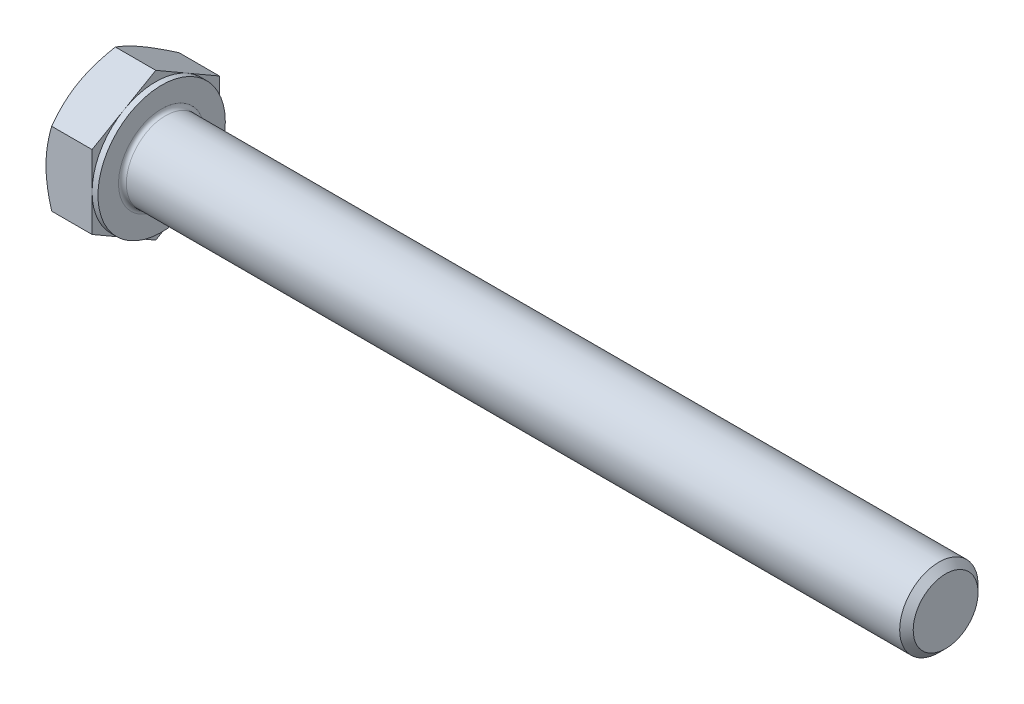
ISO-10303-21;
HEADER;
FILE_DESCRIPTION(('STEP AP214'),'2;1');
FILE_NAME('part.step','',(''),(''),'','','');
FILE_SCHEMA(('AUTOMOTIVE_DESIGN { 1 0 10303 214 1 1 1 1 }'));
ENDSEC;
DATA;
#1=APPLICATION_CONTEXT('core data for automotive mechanical design processes');
#2=APPLICATION_PROTOCOL_DEFINITION('international standard','automotive_design',2000,#1);
#3=PRODUCT_CONTEXT('',#1,'mechanical');
#4=PRODUCT('Part','Part','',(#3));
#5=PRODUCT_RELATED_PRODUCT_CATEGORY('part','',(#4));
#6=PRODUCT_DEFINITION_FORMATION('','',#4);
#7=PRODUCT_DEFINITION_CONTEXT('part definition',#1,'design');
#8=PRODUCT_DEFINITION('design','',#6,#7);
#9=PRODUCT_DEFINITION_SHAPE('','',#8);
#10=(LENGTH_UNIT() NAMED_UNIT(*) SI_UNIT(.MILLI.,.METRE.));
#11=(NAMED_UNIT(*) PLANE_ANGLE_UNIT() SI_UNIT($,.RADIAN.));
#12=(NAMED_UNIT(*) SI_UNIT($,.STERADIAN.) SOLID_ANGLE_UNIT());
#13=UNCERTAINTY_MEASURE_WITH_UNIT(LENGTH_MEASURE(1.E-05),#10,'distance_accuracy_value','');
#14=(GEOMETRIC_REPRESENTATION_CONTEXT(3) GLOBAL_UNCERTAINTY_ASSIGNED_CONTEXT((#13)) GLOBAL_UNIT_ASSIGNED_CONTEXT((#10,
#11,#12)) REPRESENTATION_CONTEXT('',''));
#15=CARTESIAN_POINT('',(0.,0.,0.));
#16=DIRECTION('',(0.,0.,1.));
#17=DIRECTION('',(1.,0.,0.));
#18=AXIS2_PLACEMENT_3D('',#15,#16,#17);
#19=CARTESIAN_POINT('',(5.3,0.,-13.));
#20=DIRECTION('',(1.,0.,0.));
#21=DIRECTION('',(0.,0.,-1.));
#22=AXIS2_PLACEMENT_3D('',#19,#20,#21);
#23=PLANE('',#22);
#24=CARTESIAN_POINT('',(5.3,0.,0.));
#25=DIRECTION('',(1.,0.,0.));
#26=DIRECTION('',(0.,0.,-1.));
#27=AXIS2_PLACEMENT_3D('',#24,#25,#26);
#28=CIRCLE('',#27,4.4);
#29=CARTESIAN_POINT('',(5.3,0.,-4.4));
#30=VERTEX_POINT('',#29);
#31=EDGE_CURVE('E43',#30,#30,#28,.F.);
#32=ORIENTED_EDGE('',*,*,#31,.T.);
#33=EDGE_LOOP('',(#32));
#34=FACE_BOUND('',#33,.T.);
#35=CARTESIAN_POINT('',(5.3,0.,0.));
#36=DIRECTION('',(1.,0.,0.));
#37=DIRECTION('',(0.,0.,-1.));
#38=AXIS2_PLACEMENT_3D('',#35,#36,#37);
#39=CIRCLE('',#38,6.5);
#40=CARTESIAN_POINT('',(5.3,0.,-6.5));
#41=VERTEX_POINT('',#40);
#42=EDGE_CURVE('E300',#41,#41,#39,.T.);
#43=ORIENTED_EDGE('',*,*,#42,.T.);
#44=EDGE_LOOP('',(#43));
#45=FACE_BOUND('',#44,.T.);
#46=ADVANCED_FACE('F35',(#34,#45),#23,.T.);
#47=CARTESIAN_POINT('',(0.,0.,0.));
#48=DIRECTION('',(-1.,0.,0.));
#49=DIRECTION('',(0.,0.,1.));
#50=AXIS2_PLACEMENT_3D('',#47,#48,#49);
#51=CYLINDRICAL_SURFACE('',#50,4.);
#52=CARTESIAN_POINT('',(5.7,0.,0.));
#53=DIRECTION('',(1.,0.,0.));
#54=DIRECTION('',(0.,0.,-1.));
#55=AXIS2_PLACEMENT_3D('',#52,#53,#54);
#56=CIRCLE('',#55,4.);
#57=CARTESIAN_POINT('',(5.7,0.,-4.));
#58=VERTEX_POINT('',#57);
#59=EDGE_CURVE('E11',#58,#58,#56,.T.);
#60=ORIENTED_EDGE('',*,*,#59,.T.);
#61=EDGE_LOOP('',(#60));
#62=FACE_BOUND('',#61,.T.);
#63=CARTESIAN_POINT('',(84.6095,0.,0.));
#64=DIRECTION('',(-1.,0.,0.));
#65=DIRECTION('',(0.,0.,1.));
#66=AXIS2_PLACEMENT_3D('',#63,#64,#65);
#67=CIRCLE('',#66,4.);
#68=CARTESIAN_POINT('',(84.6095,0.,4.));
#69=VERTEX_POINT('',#68);
#70=EDGE_CURVE('E279',#69,#69,#67,.T.);
#71=ORIENTED_EDGE('',*,*,#70,.T.);
#72=EDGE_LOOP('',(#71));
#73=FACE_BOUND('',#72,.T.);
#74=ADVANCED_FACE('F253',(#62,#73),#51,.T.);
#75=CARTESIAN_POINT('',(85.3,0.,0.));
#76=DIRECTION('',(-1.,0.,0.));
#77=DIRECTION('',(0.,0.,1.));
#78=AXIS2_PLACEMENT_3D('',#75,#76,#77);
#79=CONICAL_SURFACE('',#78,3.3095,0.78539816339744);
#80=ORIENTED_EDGE('',*,*,#70,.F.);
#81=EDGE_LOOP('',(#80));
#82=FACE_BOUND('',#81,.T.);
#83=CARTESIAN_POINT('',(85.3,0.,0.));
#84=DIRECTION('',(-1.,0.,0.));
#85=DIRECTION('',(0.,0.,1.));
#86=AXIS2_PLACEMENT_3D('',#83,#84,#85);
#87=CIRCLE('',#86,3.3095);
#88=CARTESIAN_POINT('',(85.3,0.,3.3095));
#89=VERTEX_POINT('',#88);
#90=EDGE_CURVE('E277',#89,#89,#87,.T.);
#91=ORIENTED_EDGE('',*,*,#90,.T.);
#92=EDGE_LOOP('',(#91));
#93=FACE_BOUND('',#92,.T.);
#94=ADVANCED_FACE('F258',(#82,#93),#79,.T.);
#95=CARTESIAN_POINT('',(85.3,0.,0.));
#96=DIRECTION('',(-1.,0.,0.));
#97=DIRECTION('',(0.,0.,1.));
#98=AXIS2_PLACEMENT_3D('',#95,#96,#97);
#99=PLANE('',#98);
#100=ORIENTED_EDGE('',*,*,#90,.F.);
#101=EDGE_LOOP('',(#100));
#102=FACE_BOUND('',#101,.T.);
#103=ADVANCED_FACE('F265',(#102),#99,.F.);
#104=CARTESIAN_POINT('',(4.7,6.5,0.));
#105=DIRECTION('',(1.,0.,0.));
#106=DIRECTION('',(0.,0.,-1.));
#107=AXIS2_PLACEMENT_3D('',#104,#105,#106);
#108=PLANE('',#107);
#109=DIRECTION('',(0.,0.500000000000001,0.866025403784438));
#110=VECTOR('',#109,1.);
#111=CARTESIAN_POINT('',(4.7,3.75277674973256,-6.5));
#112=LINE('',#111,#110);
#113=CARTESIAN_POINT('',(4.7,3.75277674973256,-6.5));
#114=VERTEX_POINT('',#113);
#115=CARTESIAN_POINT('',(4.7,5.62916512459885,-3.25000000000001));
#116=VERTEX_POINT('',#115);
#117=EDGE_CURVE('E167',#114,#116,#112,.T.);
#118=ORIENTED_EDGE('',*,*,#117,.T.);
#119=CARTESIAN_POINT('',(4.7,0.,0.));
#120=DIRECTION('',(-1.,0.,0.));
#121=DIRECTION('',(0.,0.,1.));
#122=AXIS2_PLACEMENT_3D('',#119,#120,#121);
#123=CIRCLE('',#122,6.5);
#124=CARTESIAN_POINT('',(4.7,0.,-6.5));
#125=VERTEX_POINT('',#124);
#126=EDGE_CURVE('E50',#116,#125,#123,.T.);
#127=ORIENTED_EDGE('',*,*,#126,.T.);
#128=DIRECTION('',(0.,1.,0.));
#129=VECTOR('',#128,1.);
#130=CARTESIAN_POINT('',(4.7,3.75277674973256,-6.5));
#131=LINE('',#130,#129);
#132=EDGE_CURVE('E303',#125,#114,#131,.T.);
#133=ORIENTED_EDGE('',*,*,#132,.T.);
#134=EDGE_LOOP('',(#118,#127,#133));
#135=FACE_BOUND('',#134,.T.);
#136=ADVANCED_FACE('F268',(#135),#108,.T.);
#137=CARTESIAN_POINT('',(4.7,7.50555349946514,0.));
#138=VERTEX_POINT('',#137);
#139=EDGE_CURVE('E165',#116,#138,#112,.T.);
#140=ORIENTED_EDGE('',*,*,#139,.T.);
#141=DIRECTION('',(0.,-0.500000000000001,0.866025403784438));
#142=VECTOR('',#141,1.);
#143=CARTESIAN_POINT('',(4.7,7.50555349946514,0.));
#144=LINE('',#143,#142);
#145=CARTESIAN_POINT('',(4.7,5.62916512459885,3.25000000000001));
#146=VERTEX_POINT('',#145);
#147=EDGE_CURVE('E164',#138,#146,#144,.T.);
#148=ORIENTED_EDGE('',*,*,#147,.T.);
#149=EDGE_CURVE('E153',#146,#116,#123,.T.);
#150=ORIENTED_EDGE('',*,*,#149,.T.);
#151=EDGE_LOOP('',(#140,#148,#150));
#152=FACE_BOUND('',#151,.T.);
#153=ADVANCED_FACE('F273',(#152),#108,.T.);
#154=CARTESIAN_POINT('',(4.7,3.75277674973256,6.5));
#155=VERTEX_POINT('',#154);
#156=EDGE_CURVE('E132',#146,#155,#144,.T.);
#157=ORIENTED_EDGE('',*,*,#156,.T.);
#158=DIRECTION('',(0.,-1.,0.));
#159=VECTOR('',#158,1.);
#160=CARTESIAN_POINT('',(4.7,3.75277674973256,6.5));
#161=LINE('',#160,#159);
#162=CARTESIAN_POINT('',(4.7,0.,6.5));
#163=VERTEX_POINT('',#162);
#164=EDGE_CURVE('E126',#155,#163,#161,.T.);
#165=ORIENTED_EDGE('',*,*,#164,.T.);
#166=EDGE_CURVE('E130',#163,#146,#123,.T.);
#167=ORIENTED_EDGE('',*,*,#166,.T.);
#168=EDGE_LOOP('',(#157,#165,#167));
#169=FACE_BOUND('',#168,.T.);
#170=ADVANCED_FACE('F128',(#169),#108,.T.);
#171=CARTESIAN_POINT('',(4.7,-3.75277674973258,6.5));
#172=VERTEX_POINT('',#171);
#173=EDGE_CURVE('E136',#163,#172,#161,.T.);
#174=ORIENTED_EDGE('',*,*,#173,.T.);
#175=DIRECTION('',(0.,-0.500000000000001,-0.866025403784438));
#176=VECTOR('',#175,1.);
#177=CARTESIAN_POINT('',(4.7,-7.50555349946516,0.));
#178=LINE('',#177,#176);
#179=CARTESIAN_POINT('',(4.7,-5.62916512459885,3.25000000000001));
#180=VERTEX_POINT('',#179);
#181=EDGE_CURVE('E143',#172,#180,#178,.T.);
#182=ORIENTED_EDGE('',*,*,#181,.T.);
#183=EDGE_CURVE('E140',#180,#163,#123,.T.);
#184=ORIENTED_EDGE('',*,*,#183,.T.);
#185=EDGE_LOOP('',(#174,#182,#184));
#186=FACE_BOUND('',#185,.T.);
#187=ADVANCED_FACE('F141',(#186),#108,.T.);
#188=CARTESIAN_POINT('',(4.7,-7.50555349946516,0.));
#189=VERTEX_POINT('',#188);
#190=EDGE_CURVE('E159',#180,#189,#178,.T.);
#191=ORIENTED_EDGE('',*,*,#190,.T.);
#192=DIRECTION('',(0.,0.500000000000002,-0.866025403784438));
#193=VECTOR('',#192,1.);
#194=CARTESIAN_POINT('',(4.7,-3.75277674973258,-6.5));
#195=LINE('',#194,#193);
#196=CARTESIAN_POINT('',(4.7,-5.62916512459884,-3.25000000000001));
#197=VERTEX_POINT('',#196);
#198=EDGE_CURVE('E341',#189,#197,#195,.T.);
#199=ORIENTED_EDGE('',*,*,#198,.T.);
#200=EDGE_CURVE('E147',#197,#180,#123,.T.);
#201=ORIENTED_EDGE('',*,*,#200,.T.);
#202=EDGE_LOOP('',(#191,#199,#201));
#203=FACE_BOUND('',#202,.T.);
#204=ADVANCED_FACE('F342',(#203),#108,.T.);
#205=CARTESIAN_POINT('',(4.7,-3.75277674973258,-6.5));
#206=VERTEX_POINT('',#205);
#207=EDGE_CURVE('E154',#197,#206,#195,.T.);
#208=ORIENTED_EDGE('',*,*,#207,.T.);
#209=EDGE_CURVE('E304',#206,#125,#131,.T.);
#210=ORIENTED_EDGE('',*,*,#209,.T.);
#211=EDGE_CURVE('E311',#125,#197,#123,.T.);
#212=ORIENTED_EDGE('',*,*,#211,.T.);
#213=EDGE_LOOP('',(#208,#210,#212));
#214=FACE_BOUND('',#213,.T.);
#215=ADVANCED_FACE('F274',(#214),#108,.T.);
#216=CARTESIAN_POINT('',(0.,0.,0.));
#217=DIRECTION('',(-1.,0.,0.));
#218=DIRECTION('',(0.,0.,1.));
#219=AXIS2_PLACEMENT_3D('',#216,#217,#218);
#220=CYLINDRICAL_SURFACE('',#219,6.5);
#221=ORIENTED_EDGE('',*,*,#126,.F.);
#222=ORIENTED_EDGE('',*,*,#149,.F.);
#223=ORIENTED_EDGE('',*,*,#166,.F.);
#224=ORIENTED_EDGE('',*,*,#183,.F.);
#225=ORIENTED_EDGE('',*,*,#200,.F.);
#226=ORIENTED_EDGE('',*,*,#211,.F.);
#227=EDGE_LOOP('',(#221,#222,#223,#224,#225,#226));
#228=FACE_BOUND('',#227,.T.);
#229=ORIENTED_EDGE('',*,*,#42,.F.);
#230=EDGE_LOOP('',(#229));
#231=FACE_BOUND('',#230,.T.);
#232=ADVANCED_FACE('F150',(#228,#231),#220,.T.);
#233=CARTESIAN_POINT('',(0.,0.,-13.));
#234=DIRECTION('',(1.,0.,0.));
#235=DIRECTION('',(0.,0.,-1.));
#236=AXIS2_PLACEMENT_3D('',#233,#234,#235);
#237=PLANE('',#236);
#238=CARTESIAN_POINT('',(0.,0.,0.));
#239=DIRECTION('',(1.,0.,0.));
#240=DIRECTION('',(0.,0.,-1.));
#241=AXIS2_PLACEMENT_3D('',#238,#239,#240);
#242=CIRCLE('',#241,6.5);
#243=CARTESIAN_POINT('',(0.,0.,-6.5));
#244=VERTEX_POINT('',#243);
#245=CARTESIAN_POINT('',(0.,5.62916512459885,-3.25000000000001));
#246=VERTEX_POINT('',#245);
#247=EDGE_CURVE('E299',#244,#246,#242,.T.);
#248=ORIENTED_EDGE('',*,*,#247,.F.);
#249=CARTESIAN_POINT('',(0.,-5.62916512459884,-3.25000000000001));
#250=VERTEX_POINT('',#249);
#251=EDGE_CURVE('E295',#250,#244,#242,.T.);
#252=ORIENTED_EDGE('',*,*,#251,.F.);
#253=CARTESIAN_POINT('',(0.,-5.62916512459885,3.25000000000001));
#254=VERTEX_POINT('',#253);
#255=EDGE_CURVE('E298',#254,#250,#242,.T.);
#256=ORIENTED_EDGE('',*,*,#255,.F.);
#257=CARTESIAN_POINT('',(0.,0.,6.5));
#258=VERTEX_POINT('',#257);
#259=EDGE_CURVE('E334',#258,#254,#242,.T.);
#260=ORIENTED_EDGE('',*,*,#259,.F.);
#261=CARTESIAN_POINT('',(0.,0.,0.));
#262=DIRECTION('',(-1.,0.,0.));
#263=DIRECTION('',(0.,0.,1.));
#264=AXIS2_PLACEMENT_3D('',#261,#262,#263);
#265=CIRCLE('',#264,6.5);
#266=CARTESIAN_POINT('',(0.,5.62916512459885,3.25000000000001));
#267=VERTEX_POINT('',#266);
#268=EDGE_CURVE('E168',#258,#267,#265,.T.);
#269=ORIENTED_EDGE('',*,*,#268,.T.);
#270=EDGE_CURVE('E357',#246,#267,#242,.T.);
#271=ORIENTED_EDGE('',*,*,#270,.F.);
#272=EDGE_LOOP('',(#248,#252,#256,#260,#269,#271));
#273=FACE_BOUND('',#272,.T.);
#274=ADVANCED_FACE('F199',(#273),#237,.F.);
#275=CARTESIAN_POINT('',(0.,0.,0.));
#276=DIRECTION('',(1.,0.,0.));
#277=DIRECTION('',(0.,0.,-1.));
#278=AXIS2_PLACEMENT_3D('',#275,#276,#277);
#279=CONICAL_SURFACE('',#278,6.5,1.0471975511966);
#280=CARTESIAN_POINT('',(0.580623251805866,3.75266127967872,6.5002));
#281=CARTESIAN_POINT('',(0.533004423075484,3.8351516191275,6.35732254094112));
#282=CARTESIAN_POINT('',(0.487546700602705,3.91794952254312,6.21391236546509));
#283=CARTESIAN_POINT('',(0.401548682023045,4.08421773795794,5.92592736868281));
#284=CARTESIAN_POINT('',(0.361010507228024,4.16768832359105,5.78135207342874));
#285=CARTESIAN_POINT('',(0.247571001123208,4.41943655294051,5.34531134947997));
#286=CARTESIAN_POINT('',(0.183047807128739,4.58870793403689,5.05212471715368));
#287=CARTESIAN_POINT('',(0.107386583547491,4.84201947708215,4.61337625445563));
#288=CARTESIAN_POINT('',(0.0858328564569875,4.92530276780316,4.46912536350531));
#289=CARTESIAN_POINT('',(0.0496903146061192,5.09224566542477,4.17997178286191));
#290=CARTESIAN_POINT('',(0.0351008844596668,5.17590523841627,4.03506915190111));
#291=CARTESIAN_POINT('',(0.0132587525073471,5.34336968579963,3.74501222057168));
#292=CARTESIAN_POINT('',(0.00599772432210821,5.427174286676,3.59985839394579));
#293=CARTESIAN_POINT('',(-0.00103969741776821,5.59485627940483,3.30942466302505));
#294=CARTESIAN_POINT('',(-0.000816322187795015,5.6787336689286,3.16414476276365));
#295=CARTESIAN_POINT('',(0.0100834585151656,5.90853103021317,2.76612405757351));
#296=CARTESIAN_POINT('',(0.0283818178694138,6.05437578112763,2.51351353897243));
#297=CARTESIAN_POINT('',(0.086406341457676,6.34509659313135,2.00997032176432));
#298=CARTESIAN_POINT('',(0.126152338538246,6.48997163178545,1.75903939406692));
#299=CARTESIAN_POINT('',(0.225505903202151,6.78127752911039,1.25448277935568));
#300=CARTESIAN_POINT('',(0.285534425638028,6.92767163007068,1.00092075856409));
#301=CARTESIAN_POINT('',(0.42177499250987,7.21827667013277,0.497578064240956));
#302=CARTESIAN_POINT('',(0.497955034163595,7.36249133098589,0.247790944447037));
#303=CARTESIAN_POINT('',(0.58062325180587,7.50566896951898,-0.000200000000000256));
#304=B_SPLINE_CURVE_WITH_KNOTS('',3,(#280,#281,#282,#283,#284,#285,#286,#287,#288,#289,#290,
#291,#292,#293,#294,#295,#296,#297,#298,#299,#300,#301,#302,#303),.UNSPECIFIED.,.F.,.F.,(4,2,2,
2,2,2,2,2,2,2,2,4),(0.,0.515105052395587,1.03043143507524,2.06322554824262,2.56697389547996,
3.07067772176453,3.57380860368928,4.0769239424252,4.9527935470566,5.82947446853466,
6.72559912449737,7.61996451221046),.UNSPECIFIED.);
#305=CARTESIAN_POINT('',(0.580556583600765,7.50555349946514,0.));
#306=VERTEX_POINT('',#305);
#307=EDGE_CURVE('E219',#267,#306,#304,.T.);
#308=ORIENTED_EDGE('',*,*,#307,.T.);
#309=CARTESIAN_POINT('',(0.58062325180587,7.50566896951898,0.0002));
#310=CARTESIAN_POINT('',(0.533004423075488,7.4231786300702,-0.142677459058881));
#311=CARTESIAN_POINT('',(0.487546700602709,7.34038072665458,-0.286087634534913));
#312=CARTESIAN_POINT('',(0.401548682023048,7.17411251123976,-0.574072631317195));
#313=CARTESIAN_POINT('',(0.361010507228028,7.09064192560665,-0.718647926571264));
#314=CARTESIAN_POINT('',(0.247571001123211,6.83889369625719,-1.15468865052003));
#315=CARTESIAN_POINT('',(0.183047807128741,6.66962231516081,-1.44787528284632));
#316=CARTESIAN_POINT('',(0.107386583547493,6.41631077211555,-1.88662374554437));
#317=CARTESIAN_POINT('',(0.0858328564569888,6.33302748139454,-2.03087463649469));
#318=CARTESIAN_POINT('',(0.04969031460612,6.16608458377293,-2.32002821713809));
#319=CARTESIAN_POINT('',(0.0351008844596674,6.08242501078143,-2.46493084809889));
#320=CARTESIAN_POINT('',(0.0132587525073476,5.91496056339806,-2.75498777942832));
#321=CARTESIAN_POINT('',(0.00599772432210863,5.8311559625217,-2.90014160605421));
#322=CARTESIAN_POINT('',(-0.00103969741776787,5.66347396979287,-3.19057533697495));
#323=CARTESIAN_POINT('',(-0.000816322187794757,5.5795965802691,-3.33585523723636));
#324=CARTESIAN_POINT('',(0.0100834585151655,5.34979921898453,-3.73387594242649));
#325=CARTESIAN_POINT('',(0.0283818178694133,5.20395446807007,-3.98648646102757));
#326=CARTESIAN_POINT('',(0.0864063414576746,4.91323365606635,-4.49002967823568));
#327=CARTESIAN_POINT('',(0.126152338538244,4.76835861741226,-4.74096060593308));
#328=CARTESIAN_POINT('',(0.225505903202148,4.47705272008731,-5.24551722064432));
#329=CARTESIAN_POINT('',(0.285534425638025,4.33065861912702,-5.49907924143591));
#330=CARTESIAN_POINT('',(0.421774992509866,4.04005357906493,-6.00242193575904));
#331=CARTESIAN_POINT('',(0.497955034163591,3.89583891821181,-6.25220905555296));
#332=CARTESIAN_POINT('',(0.580623251805865,3.75266127967872,-6.5002));
#333=B_SPLINE_CURVE_WITH_KNOTS('',3,(#309,#310,#311,#312,#313,#314,#315,#316,#317,#318,#319,
#320,#321,#322,#323,#324,#325,#326,#327,#328,#329,#330,#331,#332),.UNSPECIFIED.,.F.,.F.,(4,2,2,
2,2,2,2,2,2,2,2,4),(0.,0.515105052395587,1.03043143507525,2.06322554824262,2.56697389547997,
3.07067772176454,3.57380860368928,4.0769239424252,4.9527935470566,5.82947446853467,
6.72559912449737,7.61996451221046),.UNSPECIFIED.);
#334=EDGE_CURVE('E58',#306,#246,#333,.T.);
#335=ORIENTED_EDGE('',*,*,#334,.T.);
#336=ORIENTED_EDGE('',*,*,#270,.T.);
#337=EDGE_LOOP('',(#308,#335,#336));
#338=FACE_BOUND('',#337,.T.);
#339=ADVANCED_FACE('F358',(#338),#279,.T.);
#340=CARTESIAN_POINT('',(3.1883531156322,-10.1137456673369,6.5));
#341=CARTESIAN_POINT('',(3.05034773984572,-9.82952666268364,6.5));
#342=CARTESIAN_POINT('',(2.91365616465172,-9.54465869597372,6.5));
#343=CARTESIAN_POINT('',(2.6436389947503,-8.97327978009771,6.5));
#344=CARTESIAN_POINT('',(2.51031392437709,-8.686768583422,6.5));
#345=CARTESIAN_POINT('',(2.24710473463582,-8.11029837800203,6.5));
#346=CARTESIAN_POINT('',(2.11724300420668,-7.82032911160933,6.5));
#347=CARTESIAN_POINT('',(1.86279082811122,-7.2380954098559,6.5));
#348=CARTESIAN_POINT('',(1.73820013539999,-6.94583108282379,6.5));
#349=CARTESIAN_POINT('',(1.49176685414527,-6.34906440932192,6.5));
#350=CARTESIAN_POINT('',(1.37014257629963,-6.04447142260093,6.5));
#351=CARTESIAN_POINT('',(1.1360186574905,-5.43173420932698,6.5));
#352=CARTESIAN_POINT('',(1.02352003549993,-5.12358959057327,6.5));
#353=CARTESIAN_POINT('',(0.810575368180008,-4.50382569763976,6.5));
#354=CARTESIAN_POINT('',(0.710105232251771,-4.19221478250846,6.5));
#355=CARTESIAN_POINT('',(0.524420166111971,-3.56452019194197,6.5));
#356=CARTESIAN_POINT('',(0.439200468182013,-3.24843794783302,6.5));
#357=CARTESIAN_POINT('',(0.288524223393073,-2.61335465708695,6.5));
#358=CARTESIAN_POINT('',(0.222961865744184,-2.29437912058768,6.5));
#359=CARTESIAN_POINT('',(0.115312883140196,-1.65238219411908,6.5));
#360=CARTESIAN_POINT('',(0.0732239014810127,-1.32936121363908,6.5));
#361=CARTESIAN_POINT('',(0.0304887136492818,-0.84523117198599,6.5));
#362=CARTESIAN_POINT('',(0.0196493434374837,-0.684982209825937,6.5));
#363=CARTESIAN_POINT('',(0.00475298486802969,-0.364162349261919,6.5));
#364=CARTESIAN_POINT('',(0.000695882912928064,-0.203591456295132,6.5));
#365=CARTESIAN_POINT('',(-0.000531597192430714,0.117577430127586,6.5));
#366=CARTESIAN_POINT('',(0.00229809016385308,0.278175423826768,6.5));
#367=CARTESIAN_POINT('',(0.0147726845392773,0.599108972527021,6.5));
#368=CARTESIAN_POINT('',(0.0244179260292904,0.759444514261289,6.5));
#369=CARTESIAN_POINT('',(0.055496193900561,1.1436994656868,6.5));
#370=CARTESIAN_POINT('',(0.0801030490102264,1.36736763010323,6.5));
#371=CARTESIAN_POINT('',(0.141246537396775,1.81305591275146,6.5));
#372=CARTESIAN_POINT('',(0.177784759549959,2.03507580745698,6.5));
#373=CARTESIAN_POINT('',(0.303360001243781,2.69839633393825,6.5));
#374=CARTESIAN_POINT('',(0.408335815043152,3.13672010332745,6.5));
#375=CARTESIAN_POINT('',(0.590564593006709,3.7923211287405,6.5));
#376=CARTESIAN_POINT('',(0.656313198842875,4.0129915082917,6.5));
#377=CARTESIAN_POINT('',(0.794681634048782,4.45218858961825,6.5));
#378=CARTESIAN_POINT('',(0.867301512962919,4.67071527592427,6.5));
#379=CARTESIAN_POINT('',(1.01824353836802,5.10569490203686,6.5));
#380=CARTESIAN_POINT('',(1.09656388214598,5.32214847315215,6.5));
#381=CARTESIAN_POINT('',(1.2579808614511,5.75325725721537,6.5));
#382=CARTESIAN_POINT('',(1.34107741015562,5.96791250277233,6.5));
#383=CARTESIAN_POINT('',(1.56029019561415,6.5188844588354,6.5));
#384=CARTESIAN_POINT('',(1.69936356644503,6.85402316761086,6.5));
#385=CARTESIAN_POINT('',(1.98501958064621,7.52109583887399,6.5));
#386=CARTESIAN_POINT('',(2.13160288757764,7.85302951508194,6.5));
#387=CARTESIAN_POINT('',(2.43059748021415,8.51437865467403,6.5));
#388=CARTESIAN_POINT('',(2.5830105757321,8.84379329733067,6.5));
#389=CARTESIAN_POINT('',(2.89234869350808,9.5004779863319,6.5));
#390=CARTESIAN_POINT('',(3.04927357195784,9.82774810062367,6.5));
#391=CARTESIAN_POINT('',(3.366920131061,10.4809971970749,6.5));
#392=CARTESIAN_POINT('',(3.52764676467091,10.8069737662429,6.5));
#393=CARTESIAN_POINT('',(3.85198555530079,11.4574882896092,6.5));
#394=CARTESIAN_POINT('',(4.01559773098172,11.7820262344869,6.5));
#395=CARTESIAN_POINT('',(4.50986184978697,12.753746810957,6.5));
#396=CARTESIAN_POINT('',(4.84399997953393,13.399155592763,6.5));
#397=CARTESIAN_POINT('',(5.48575990240557,14.6239779286089,6.5));
#398=CARTESIAN_POINT('',(5.79279643346765,15.20369957558,6.5));
#399=CARTESIAN_POINT('',(6.41069188201846,16.361138263307,6.5));
#400=CARTESIAN_POINT('',(6.72155098984205,16.9388552023925,6.5));
#401=CARTESIAN_POINT('',(7.34519775412869,18.0910273551188,6.5));
#402=CARTESIAN_POINT('',(7.65797694142596,18.6654871601313,6.5));
#403=CARTESIAN_POINT('',(8.28574397126581,19.8131486199609,6.5));
#404=CARTESIAN_POINT('',(8.60073166267674,20.386350357412,6.5));
#405=CARTESIAN_POINT('',(8.91652967142034,20.9591024516605,6.5));
#406=B_SPLINE_CURVE_WITH_KNOTS('',3,(#340,#341,#342,#343,#344,#345,#346,#347,#348,#349,#350,
#351,#352,#353,#354,#355,#356,#357,#358,#359,#360,#361,#362,#363,#364,#365,#366,#367,#368,#369,
#370,#371,#372,#373,#374,#375,#376,#377,#378,#379,#380,#381,#382,#383,#384,#385,#386,#387,#388,
#389,#390,#391,#392,#393,#394,#395,#396,#397,#398,#399,#400,#401,#402,#403,#404,#405),
.UNSPECIFIED.,.F.,.F.,(4,2,2,2,2,2,2,2,2,2,2,2,2,2,2,2,2,2,2,2,2,2,2,2,2,2,2,2,2,2,2,2,4),(0.,
0.947868666637002,1.89588406470429,2.8490032091087,3.80207763278045,4.78589774049431,
5.7698275510146,6.75175256199404,7.73337005710131,8.70960474826446,9.6857414087631,
10.1674651045585,10.6491807317952,11.1309009410869,11.612644792267,12.2873175714038,
12.9620802320305,14.3123184370259,15.0030310333297,15.6937486103038,16.3842486961975,
17.074736234034,18.1631508671877,19.2516618366358,20.3405135130783,21.4293305219254,
22.519654053591,23.6099846390269,25.7902468223405,27.7582608860787,29.7263733417655,
31.6886408583916,33.6507753794604),.UNSPECIFIED.);
#407=CARTESIAN_POINT('',(0.580556583600761,3.75277674973256,6.5));
#408=VERTEX_POINT('',#407);
#409=EDGE_CURVE('E233',#258,#408,#406,.T.);
#410=ORIENTED_EDGE('',*,*,#409,.T.);
#411=EDGE_CURVE('E232',#408,#267,#304,.T.);
#412=ORIENTED_EDGE('',*,*,#411,.T.);
#413=ORIENTED_EDGE('',*,*,#268,.F.);
#414=EDGE_LOOP('',(#410,#412,#413));
#415=FACE_BOUND('',#414,.T.);
#416=ADVANCED_FACE('F328',(#415),#279,.T.);
#417=CARTESIAN_POINT('',(0.580556583600768,-3.75277674973258,6.5));
#418=VERTEX_POINT('',#417);
#419=EDGE_CURVE('E280',#418,#258,#406,.T.);
#420=ORIENTED_EDGE('',*,*,#419,.T.);
#421=ORIENTED_EDGE('',*,*,#259,.T.);
#422=CARTESIAN_POINT('',(0.580623251805882,-7.505668969519,-0.000200000000000128));
#423=CARTESIAN_POINT('',(0.5330044230755,-7.42317863007022,0.142677459058881));
#424=CARTESIAN_POINT('',(0.48754670060272,-7.3403807266546,0.286087634534913));
#425=CARTESIAN_POINT('',(0.401548682023059,-7.17411251123978,0.574072631317196));
#426=CARTESIAN_POINT('',(0.361010507228039,-7.09064192560667,0.718647926571266));
#427=CARTESIAN_POINT('',(0.247571001123222,-6.83889369625721,1.15468865052004));
#428=CARTESIAN_POINT('',(0.183047807128752,-6.66962231516083,1.44787528284632));
#429=CARTESIAN_POINT('',(0.107386583547503,-6.41631077211557,1.88662374554438));
#430=CARTESIAN_POINT('',(0.0858328564569992,-6.33302748139456,2.0308746364947));
#431=CARTESIAN_POINT('',(0.0496903146061306,-6.16608458377295,2.32002821713809));
#432=CARTESIAN_POINT('',(0.0351008844596782,-6.08242501078145,2.46493084809889));
#433=CARTESIAN_POINT('',(0.0132587525073581,-5.91496056339808,2.75498777942833));
#434=CARTESIAN_POINT('',(0.00599772432211894,-5.83115596252172,2.90014160605422));
#435=CARTESIAN_POINT('',(-0.0010396974177579,-5.66347396979288,3.19057533697496));
#436=CARTESIAN_POINT('',(-0.000816322187784871,-5.57959658026912,3.33585523723637));
#437=CARTESIAN_POINT('',(0.0100834585151753,-5.34979921898454,3.7338759424265));
#438=CARTESIAN_POINT('',(0.0283818178694232,-5.20395446807008,3.98648646102758));
#439=CARTESIAN_POINT('',(0.0864063414576841,-4.91323365606637,4.49002967823569));
#440=CARTESIAN_POINT('',(0.126152338538253,-4.76835861741227,4.74096060593309));
#441=CARTESIAN_POINT('',(0.225505903202156,-4.47705272008733,5.24551722064433));
#442=CARTESIAN_POINT('',(0.285534425638033,-4.33065861912704,5.49907924143592));
#443=CARTESIAN_POINT('',(0.421774992509874,-4.04005357906495,6.00242193575905));
#444=CARTESIAN_POINT('',(0.497955034163599,-3.89583891821183,6.25220905555296));
#445=CARTESIAN_POINT('',(0.580623251805872,-3.75266127967874,6.5002));
#446=B_SPLINE_CURVE_WITH_KNOTS('',3,(#422,#423,#424,#425,#426,#427,#428,#429,#430,#431,#432,
#433,#434,#435,#436,#437,#438,#439,#440,#441,#442,#443,#444,#445),.UNSPECIFIED.,.F.,.F.,(4,2,2,
2,2,2,2,2,2,2,2,4),(0.,0.51510505239559,1.03043143507525,2.06322554824263,2.56697389547997,
3.07067772176455,3.57380860368929,4.07692394242521,4.95279354705661,5.82947446853467,
6.72559912449737,7.61996451221046),.UNSPECIFIED.);
#447=EDGE_CURVE('E221',#254,#418,#446,.T.);
#448=ORIENTED_EDGE('',*,*,#447,.T.);
#449=EDGE_LOOP('',(#420,#421,#448));
#450=FACE_BOUND('',#449,.T.);
#451=ADVANCED_FACE('F188',(#450),#279,.T.);
#452=CARTESIAN_POINT('',(0.580556583600778,-7.50555349946516,0.));
#453=VERTEX_POINT('',#452);
#454=EDGE_CURVE('E213',#453,#254,#446,.T.);
#455=ORIENTED_EDGE('',*,*,#454,.T.);
#456=ORIENTED_EDGE('',*,*,#255,.T.);
#457=CARTESIAN_POINT('',(0.58062325180587,-3.75266127967874,-6.5002));
#458=CARTESIAN_POINT('',(0.533004423075488,-3.83515161912752,-6.35732254094112));
#459=CARTESIAN_POINT('',(0.487546700602709,-3.91794952254314,-6.21391236546509));
#460=CARTESIAN_POINT('',(0.401548682023049,-4.08421773795796,-5.9259273686828));
#461=CARTESIAN_POINT('',(0.361010507228029,-4.16768832359107,-5.78135207342873));
#462=CARTESIAN_POINT('',(0.247571001123213,-4.41943655294053,-5.34531134947996));
#463=CARTESIAN_POINT('',(0.183047807128745,-4.58870793403691,-5.05212471715368));
#464=CARTESIAN_POINT('',(0.107386583547498,-4.84201947708217,-4.61337625445563));
#465=CARTESIAN_POINT('',(0.0858328564569943,-4.92530276780318,-4.46912536350531));
#466=CARTESIAN_POINT('',(0.0496903146061265,-5.09224566542479,-4.17997178286191));
#467=CARTESIAN_POINT('',(0.0351008844596746,-5.17590523841629,-4.03506915190111));
#468=CARTESIAN_POINT('',(0.0132587525073554,-5.34336968579965,-3.74501222057168));
#469=CARTESIAN_POINT('',(0.0059977243221165,-5.42717428667602,-3.59985839394579));
#470=CARTESIAN_POINT('',(-0.00103969741775921,-5.59485627940485,-3.30942466302505));
#471=CARTESIAN_POINT('',(-0.000816322187785332,-5.67873366892862,-3.16414476276364));
#472=CARTESIAN_POINT('',(0.0100834585151765,-5.90853103021319,-2.76612405757351));
#473=CARTESIAN_POINT('',(0.0283818178694248,-6.05437578112765,-2.51351353897243));
#474=CARTESIAN_POINT('',(0.086406341457687,-6.34509659313137,-2.00997032176432));
#475=CARTESIAN_POINT('',(0.126152338538257,-6.48997163178547,-1.75903939406692));
#476=CARTESIAN_POINT('',(0.225505903202162,-6.78127752911041,-1.25448277935568));
#477=CARTESIAN_POINT('',(0.28553442563804,-6.9276716300707,-1.00092075856409));
#478=CARTESIAN_POINT('',(0.421774992509883,-7.21827667013279,-0.497578064240955));
#479=CARTESIAN_POINT('',(0.497955034163608,-7.36249133098591,-0.247790944447036));
#480=CARTESIAN_POINT('',(0.580623251805882,-7.505668969519,0.000200000000000529));
#481=B_SPLINE_CURVE_WITH_KNOTS('',3,(#457,#458,#459,#460,#461,#462,#463,#464,#465,#466,#467,
#468,#469,#470,#471,#472,#473,#474,#475,#476,#477,#478,#479,#480),.UNSPECIFIED.,.F.,.F.,(4,2,2,
2,2,2,2,2,2,2,2,4),(0.,0.515105052395588,1.03043143507525,2.06322554824262,2.56697389547997,
3.07067772176454,3.57380860368928,4.0769239424252,4.9527935470566,5.82947446853467,
6.72559912449737,7.61996451221046),.UNSPECIFIED.);
#482=EDGE_CURVE('E220',#250,#453,#481,.T.);
#483=ORIENTED_EDGE('',*,*,#482,.T.);
#484=EDGE_LOOP('',(#455,#456,#483));
#485=FACE_BOUND('',#484,.T.);
#486=ADVANCED_FACE('F356',(#485),#279,.T.);
#487=CARTESIAN_POINT('',(0.580556583600761,3.75277674973256,-6.5));
#488=VERTEX_POINT('',#487);
#489=EDGE_CURVE('E222',#246,#488,#333,.T.);
#490=ORIENTED_EDGE('',*,*,#489,.T.);
#491=CARTESIAN_POINT('',(3.18835311563219,-10.1137456673369,-6.5));
#492=CARTESIAN_POINT('',(3.05034773984572,-9.82952666268364,-6.5));
#493=CARTESIAN_POINT('',(2.91365616465172,-9.54465869597372,-6.5));
#494=CARTESIAN_POINT('',(2.64363899475029,-8.9732797800977,-6.5));
#495=CARTESIAN_POINT('',(2.51031392437709,-8.68676858342199,-6.5));
#496=CARTESIAN_POINT('',(2.24710473463581,-8.11029837800202,-6.5));
#497=CARTESIAN_POINT('',(2.11724300420667,-7.82032911160933,-6.5));
#498=CARTESIAN_POINT('',(1.86279082811121,-7.2380954098559,-6.5));
#499=CARTESIAN_POINT('',(1.73820013539999,-6.94583108282378,-6.5));
#500=CARTESIAN_POINT('',(1.49176685414527,-6.34906440932192,-6.5));
#501=CARTESIAN_POINT('',(1.37014257629963,-6.04447142260092,-6.5));
#502=CARTESIAN_POINT('',(1.13601865749049,-5.43173420932698,-6.5));
#503=CARTESIAN_POINT('',(1.02352003549993,-5.12358959057326,-6.5));
#504=CARTESIAN_POINT('',(0.810575368180006,-4.50382569763975,-6.5));
#505=CARTESIAN_POINT('',(0.710105232251769,-4.19221478250845,-6.5));
#506=CARTESIAN_POINT('',(0.524420166111969,-3.56452019194197,-6.5));
#507=CARTESIAN_POINT('',(0.439200468182012,-3.24843794783301,-6.5));
#508=CARTESIAN_POINT('',(0.288524223393071,-2.61335465708694,-6.5));
#509=CARTESIAN_POINT('',(0.222961865744183,-2.29437912058768,-6.5));
#510=CARTESIAN_POINT('',(0.115312883140195,-1.65238219411908,-6.5));
#511=CARTESIAN_POINT('',(0.0732239014810114,-1.32936121363908,-6.5));
#512=CARTESIAN_POINT('',(0.0304887136492802,-0.845231171985987,-6.5));
#513=CARTESIAN_POINT('',(0.0196493434374821,-0.684982209825934,-6.5));
#514=CARTESIAN_POINT('',(0.00475298486802829,-0.364162349261916,-6.5));
#515=CARTESIAN_POINT('',(0.000695882912926946,-0.203591456295129,-6.5));
#516=CARTESIAN_POINT('',(-0.000531597192431596,0.117577430127588,-6.5));
#517=CARTESIAN_POINT('',(0.00229809016385213,0.278175423826769,-6.5));
#518=CARTESIAN_POINT('',(0.0147726845392763,0.599108972527023,-6.5));
#519=CARTESIAN_POINT('',(0.0244179260292894,0.75944451426129,-6.5));
#520=CARTESIAN_POINT('',(0.05549619390056,1.1436994656868,-6.5));
#521=CARTESIAN_POINT('',(0.0801030490102253,1.36736763010323,-6.5));
#522=CARTESIAN_POINT('',(0.141246537396774,1.81305591275146,-6.5));
#523=CARTESIAN_POINT('',(0.177784759549958,2.03507580745698,-6.5));
#524=CARTESIAN_POINT('',(0.30336000124378,2.69839633393825,-6.5));
#525=CARTESIAN_POINT('',(0.408335815043151,3.13672010332745,-6.5));
#526=CARTESIAN_POINT('',(0.590564593006708,3.7923211287405,-6.5));
#527=CARTESIAN_POINT('',(0.656313198842874,4.01299150829169,-6.5));
#528=CARTESIAN_POINT('',(0.794681634048781,4.45218858961825,-6.5));
#529=CARTESIAN_POINT('',(0.867301512962918,4.67071527592427,-6.5));
#530=CARTESIAN_POINT('',(1.01824353836802,5.10569490203686,-6.5));
#531=CARTESIAN_POINT('',(1.09656388214598,5.32214847315215,-6.5));
#532=CARTESIAN_POINT('',(1.2579808614511,5.75325725721537,-6.5));
#533=CARTESIAN_POINT('',(1.34107741015561,5.96791250277233,-6.5));
#534=CARTESIAN_POINT('',(1.56029019561415,6.5188844588354,-6.5));
#535=CARTESIAN_POINT('',(1.69936356644502,6.85402316761086,-6.5));
#536=CARTESIAN_POINT('',(1.98501958064621,7.52109583887399,-6.5));
#537=CARTESIAN_POINT('',(2.13160288757764,7.85302951508194,-6.5));
#538=CARTESIAN_POINT('',(2.43059748021415,8.51437865467402,-6.5));
#539=CARTESIAN_POINT('',(2.58301057573209,8.84379329733067,-6.5));
#540=CARTESIAN_POINT('',(2.89234869350807,9.5004779863319,-6.5));
#541=CARTESIAN_POINT('',(3.04927357195784,9.82774810062367,-6.5));
#542=CARTESIAN_POINT('',(3.366920131061,10.4809971970749,-6.5));
#543=CARTESIAN_POINT('',(3.52764676467091,10.8069737662429,-6.5));
#544=CARTESIAN_POINT('',(3.85198555530078,11.4574882896092,-6.5));
#545=CARTESIAN_POINT('',(4.01559773098172,11.7820262344869,-6.5));
#546=CARTESIAN_POINT('',(4.50986184978697,12.753746810957,-6.5));
#547=CARTESIAN_POINT('',(4.84399997953393,13.399155592763,-6.5));
#548=CARTESIAN_POINT('',(5.48575990240556,14.6239779286089,-6.5));
#549=CARTESIAN_POINT('',(5.79279643346765,15.20369957558,-6.5));
#550=CARTESIAN_POINT('',(6.41069188201845,16.361138263307,-6.5));
#551=CARTESIAN_POINT('',(6.72155098984204,16.9388552023925,-6.5));
#552=CARTESIAN_POINT('',(7.34519775412868,18.0910273551188,-6.5));
#553=CARTESIAN_POINT('',(7.65797694142596,18.6654871601313,-6.5));
#554=CARTESIAN_POINT('',(8.28574397126581,19.8131486199609,-6.5));
#555=CARTESIAN_POINT('',(8.60073166267674,20.386350357412,-6.5));
#556=CARTESIAN_POINT('',(8.91652967142034,20.9591024516605,-6.5));
#557=B_SPLINE_CURVE_WITH_KNOTS('',3,(#491,#492,#493,#494,#495,#496,#497,#498,#499,#500,#501,
#502,#503,#504,#505,#506,#507,#508,#509,#510,#511,#512,#513,#514,#515,#516,#517,#518,#519,#520,
#521,#522,#523,#524,#525,#526,#527,#528,#529,#530,#531,#532,#533,#534,#535,#536,#537,#538,#539,
#540,#541,#542,#543,#544,#545,#546,#547,#548,#549,#550,#551,#552,#553,#554,#555,#556),
.UNSPECIFIED.,.F.,.F.,(4,2,2,2,2,2,2,2,2,2,2,2,2,2,2,2,2,2,2,2,2,2,2,2,2,2,2,2,2,2,2,2,4),(0.,
0.947868666637002,1.89588406470429,2.8490032091087,3.80207763278045,4.78589774049431,
5.7698275510146,6.75175256199404,7.7333700571013,8.70960474826445,9.6857414087631,
10.1674651045585,10.6491807317952,11.1309009410869,11.612644792267,12.2873175714037,
12.9620802320305,14.3123184370259,15.0030310333297,15.6937486103038,16.3842486961975,
17.074736234034,18.1631508671877,19.2516618366358,20.3405135130782,21.4293305219254,
22.5196540535909,23.6099846390268,25.7902468223404,27.7582608860787,29.7263733417655,
31.6886408583916,33.6507753794604),.UNSPECIFIED.);
#558=EDGE_CURVE('E180',#488,#244,#557,.F.);
#559=ORIENTED_EDGE('',*,*,#558,.T.);
#560=ORIENTED_EDGE('',*,*,#247,.T.);
#561=EDGE_LOOP('',(#490,#559,#560));
#562=FACE_BOUND('',#561,.T.);
#563=ADVANCED_FACE('F353',(#562),#279,.T.);
#564=CARTESIAN_POINT('',(0.580556583600766,-3.75277674973258,-6.5));
#565=VERTEX_POINT('',#564);
#566=EDGE_CURVE('E181',#565,#250,#481,.T.);
#567=ORIENTED_EDGE('',*,*,#566,.T.);
#568=ORIENTED_EDGE('',*,*,#251,.T.);
#569=EDGE_CURVE('E171',#244,#565,#557,.F.);
#570=ORIENTED_EDGE('',*,*,#569,.T.);
#571=EDGE_LOOP('',(#567,#568,#570));
#572=FACE_BOUND('',#571,.T.);
#573=ADVANCED_FACE('F197',(#572),#279,.T.);
#574=CARTESIAN_POINT('',(5.3,3.75277674973256,-6.5));
#575=DIRECTION('',(0.,0.,1.));
#576=DIRECTION('',(1.,0.,0.));
#577=AXIS2_PLACEMENT_3D('',#574,#575,#576);
#578=PLANE('',#577);
#579=ORIENTED_EDGE('',*,*,#209,.F.);
#580=DIRECTION('',(-1.,0.,0.));
#581=VECTOR('',#580,1.);
#582=CARTESIAN_POINT('',(5.3,-3.75277674973258,-6.5));
#583=LINE('',#582,#581);
#584=EDGE_CURVE('E286',#206,#565,#583,.T.);
#585=ORIENTED_EDGE('',*,*,#584,.T.);
#586=ORIENTED_EDGE('',*,*,#569,.F.);
#587=ORIENTED_EDGE('',*,*,#558,.F.);
#588=DIRECTION('',(-1.,0.,0.));
#589=VECTOR('',#588,1.);
#590=CARTESIAN_POINT('',(5.3,3.75277674973256,-6.5));
#591=LINE('',#590,#589);
#592=EDGE_CURVE('E282',#114,#488,#591,.T.);
#593=ORIENTED_EDGE('',*,*,#592,.F.);
#594=ORIENTED_EDGE('',*,*,#132,.F.);
#595=EDGE_LOOP('',(#579,#585,#586,#587,#593,#594));
#596=FACE_BOUND('',#595,.T.);
#597=ADVANCED_FACE('F192',(#596),#578,.F.);
#598=CARTESIAN_POINT('',(5.3,-3.75277674973258,-6.5));
#599=DIRECTION('',(0.,0.866025403784438,0.500000000000002));
#600=DIRECTION('',(0.,-0.500000000000002,0.866025403784438));
#601=AXIS2_PLACEMENT_3D('',#598,#599,#600);
#602=PLANE('',#601);
#603=ORIENTED_EDGE('',*,*,#198,.F.);
#604=DIRECTION('',(-1.,0.,0.));
#605=VECTOR('',#604,1.);
#606=CARTESIAN_POINT('',(5.3,-7.50555349946516,0.));
#607=LINE('',#606,#605);
#608=EDGE_CURVE('E288',#189,#453,#607,.T.);
#609=ORIENTED_EDGE('',*,*,#608,.T.);
#610=ORIENTED_EDGE('',*,*,#482,.F.);
#611=ORIENTED_EDGE('',*,*,#566,.F.);
#612=ORIENTED_EDGE('',*,*,#584,.F.);
#613=ORIENTED_EDGE('',*,*,#207,.F.);
#614=EDGE_LOOP('',(#603,#609,#610,#611,#612,#613));
#615=FACE_BOUND('',#614,.T.);
#616=ADVANCED_FACE('F196',(#615),#602,.F.);
#617=CARTESIAN_POINT('',(5.3,-7.50555349946516,0.));
#618=DIRECTION('',(0.,0.866025403784438,-0.500000000000001));
#619=DIRECTION('',(0.,0.500000000000001,0.866025403784438));
#620=AXIS2_PLACEMENT_3D('',#617,#618,#619);
#621=PLANE('',#620);
#622=ORIENTED_EDGE('',*,*,#181,.F.);
#623=DIRECTION('',(-1.,0.,0.));
#624=VECTOR('',#623,1.);
#625=CARTESIAN_POINT('',(5.3,-3.75277674973258,6.5));
#626=LINE('',#625,#624);
#627=EDGE_CURVE('E158',#172,#418,#626,.T.);
#628=ORIENTED_EDGE('',*,*,#627,.T.);
#629=ORIENTED_EDGE('',*,*,#447,.F.);
#630=ORIENTED_EDGE('',*,*,#454,.F.);
#631=ORIENTED_EDGE('',*,*,#608,.F.);
#632=ORIENTED_EDGE('',*,*,#190,.F.);
#633=EDGE_LOOP('',(#622,#628,#629,#630,#631,#632));
#634=FACE_BOUND('',#633,.T.);
#635=ADVANCED_FACE('F204',(#634),#621,.F.);
#636=CARTESIAN_POINT('',(5.3,3.75277674973256,6.5));
#637=DIRECTION('',(0.,0.,-1.));
#638=DIRECTION('',(-1.,0.,0.));
#639=AXIS2_PLACEMENT_3D('',#636,#637,#638);
#640=PLANE('',#639);
#641=ORIENTED_EDGE('',*,*,#164,.F.);
#642=DIRECTION('',(-1.,0.,0.));
#643=VECTOR('',#642,1.);
#644=CARTESIAN_POINT('',(5.3,3.75277674973256,6.5));
#645=LINE('',#644,#643);
#646=EDGE_CURVE('E291',#155,#408,#645,.T.);
#647=ORIENTED_EDGE('',*,*,#646,.T.);
#648=ORIENTED_EDGE('',*,*,#409,.F.);
#649=ORIENTED_EDGE('',*,*,#419,.F.);
#650=ORIENTED_EDGE('',*,*,#627,.F.);
#651=ORIENTED_EDGE('',*,*,#173,.F.);
#652=EDGE_LOOP('',(#641,#647,#648,#649,#650,#651));
#653=FACE_BOUND('',#652,.T.);
#654=ADVANCED_FACE('F156',(#653),#640,.F.);
#655=CARTESIAN_POINT('',(5.3,7.50555349946514,0.));
#656=DIRECTION('',(0.,-0.866025403784438,-0.500000000000001));
#657=DIRECTION('',(0.,0.500000000000001,-0.866025403784438));
#658=AXIS2_PLACEMENT_3D('',#655,#656,#657);
#659=PLANE('',#658);
#660=ORIENTED_EDGE('',*,*,#147,.F.);
#661=DIRECTION('',(-1.,0.,0.));
#662=VECTOR('',#661,1.);
#663=CARTESIAN_POINT('',(5.3,7.50555349946514,0.));
#664=LINE('',#663,#662);
#665=EDGE_CURVE('E293',#138,#306,#664,.T.);
#666=ORIENTED_EDGE('',*,*,#665,.T.);
#667=ORIENTED_EDGE('',*,*,#307,.F.);
#668=ORIENTED_EDGE('',*,*,#411,.F.);
#669=ORIENTED_EDGE('',*,*,#646,.F.);
#670=ORIENTED_EDGE('',*,*,#156,.F.);
#671=EDGE_LOOP('',(#660,#666,#667,#668,#669,#670));
#672=FACE_BOUND('',#671,.T.);
#673=ADVANCED_FACE('F239',(#672),#659,.F.);
#674=CARTESIAN_POINT('',(5.3,3.75277674973256,-6.5));
#675=DIRECTION('',(0.,-0.866025403784438,0.500000000000001));
#676=DIRECTION('',(0.,-0.500000000000001,-0.866025403784438));
#677=AXIS2_PLACEMENT_3D('',#674,#675,#676);
#678=PLANE('',#677);
#679=ORIENTED_EDGE('',*,*,#117,.F.);
#680=ORIENTED_EDGE('',*,*,#592,.T.);
#681=ORIENTED_EDGE('',*,*,#489,.F.);
#682=ORIENTED_EDGE('',*,*,#334,.F.);
#683=ORIENTED_EDGE('',*,*,#665,.F.);
#684=ORIENTED_EDGE('',*,*,#139,.F.);
#685=EDGE_LOOP('',(#679,#680,#681,#682,#683,#684));
#686=FACE_BOUND('',#685,.T.);
#687=ADVANCED_FACE('F242',(#686),#678,.F.);
#688=CARTESIAN_POINT('',(5.7,0.,0.));
#689=DIRECTION('',(1.,0.,0.));
#690=DIRECTION('',(0.,0.,-1.));
#691=AXIS2_PLACEMENT_3D('',#688,#689,#690);
#692=TOROIDAL_SURFACE('',#691,4.4,0.4);
#693=ORIENTED_EDGE('',*,*,#59,.F.);
#694=EDGE_LOOP('',(#693));
#695=FACE_BOUND('',#694,.T.);
#696=ORIENTED_EDGE('',*,*,#31,.F.);
#697=EDGE_LOOP('',(#696));
#698=FACE_BOUND('',#697,.T.);
#699=ADVANCED_FACE('F37',(#695,#698),#692,.F.);
#700=CLOSED_SHELL('',(#46,#74,#94,#103,#136,#153,#170,#187,#204,#215,#232,#274,#339,#416,#451,
#486,#563,#573,#597,#616,#635,#654,#673,#687,#699));
#701=MANIFOLD_SOLID_BREP('B2',#700);
#702=ADVANCED_BREP_SHAPE_REPRESENTATION('',(#18,#701),#14);
#703=SHAPE_DEFINITION_REPRESENTATION(#9,#702);
ENDSEC;
END-ISO-10303-21;
